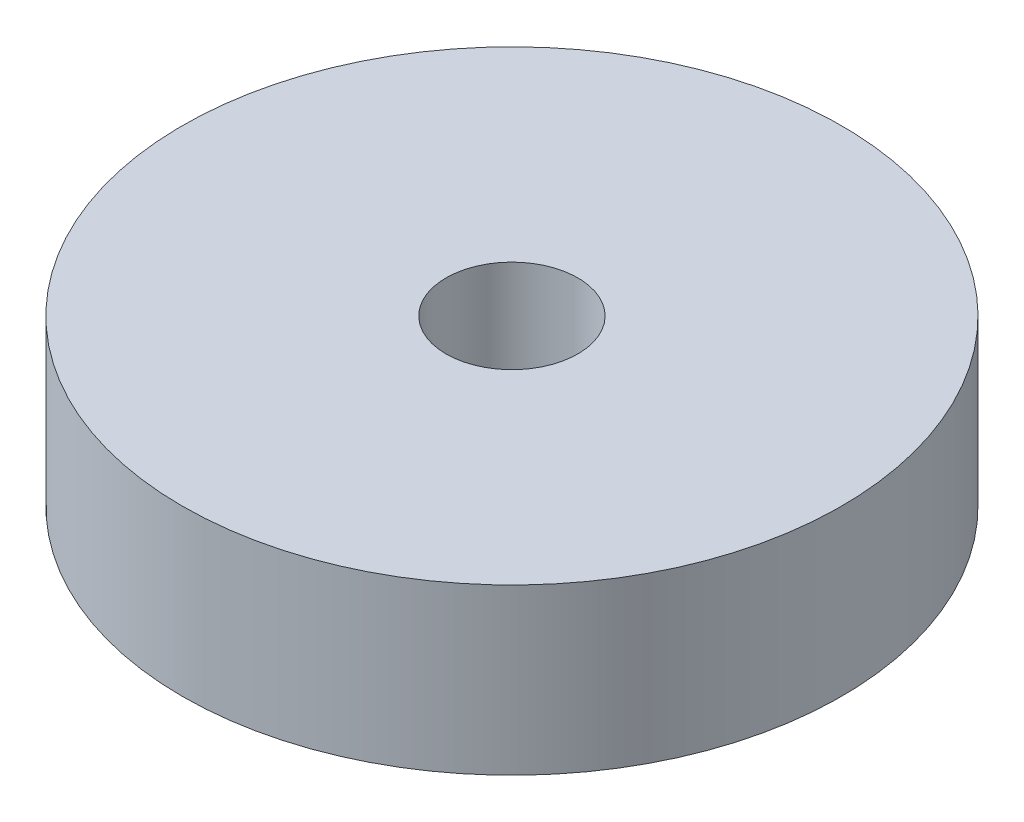
ISO-10303-21;
HEADER;
FILE_DESCRIPTION(('STEP AP214'),'2;1');
FILE_NAME('part.step','',(''),(''),'','','');
FILE_SCHEMA(('AUTOMOTIVE_DESIGN { 1 0 10303 214 1 1 1 1 }'));
ENDSEC;
DATA;
#1=APPLICATION_CONTEXT('core data for automotive mechanical design processes');
#2=APPLICATION_PROTOCOL_DEFINITION('international standard','automotive_design',2000,#1);
#3=PRODUCT_CONTEXT('',#1,'mechanical');
#4=PRODUCT('Part','Part','',(#3));
#5=PRODUCT_RELATED_PRODUCT_CATEGORY('part','',(#4));
#6=PRODUCT_DEFINITION_FORMATION('','',#4);
#7=PRODUCT_DEFINITION_CONTEXT('part definition',#1,'design');
#8=PRODUCT_DEFINITION('design','',#6,#7);
#9=PRODUCT_DEFINITION_SHAPE('','',#8);
#10=(LENGTH_UNIT() NAMED_UNIT(*) SI_UNIT(.MILLI.,.METRE.));
#11=(NAMED_UNIT(*) PLANE_ANGLE_UNIT() SI_UNIT($,.RADIAN.));
#12=(NAMED_UNIT(*) SI_UNIT($,.STERADIAN.) SOLID_ANGLE_UNIT());
#13=UNCERTAINTY_MEASURE_WITH_UNIT(LENGTH_MEASURE(1.E-05),#10,'distance_accuracy_value','');
#14=(GEOMETRIC_REPRESENTATION_CONTEXT(3) GLOBAL_UNCERTAINTY_ASSIGNED_CONTEXT((#13)) GLOBAL_UNIT_ASSIGNED_CONTEXT((#10,
#11,#12)) REPRESENTATION_CONTEXT('',''));
#15=CARTESIAN_POINT('',(0.,0.,0.));
#16=DIRECTION('',(0.,0.,1.));
#17=DIRECTION('',(1.,0.,0.));
#18=AXIS2_PLACEMENT_3D('',#15,#16,#17);
#19=CARTESIAN_POINT('',(0.,0.,0.));
#20=DIRECTION('',(0.,1.,0.));
#21=DIRECTION('',(0.,0.,1.));
#22=AXIS2_PLACEMENT_3D('',#19,#20,#21);
#23=PLANE('',#22);
#24=CARTESIAN_POINT('',(0.,0.,0.));
#25=DIRECTION('',(0.,1.,0.));
#26=DIRECTION('',(0.,0.,1.));
#27=AXIS2_PLACEMENT_3D('',#24,#25,#26);
#28=CIRCLE('',#27,4.);
#29=CARTESIAN_POINT('',(0.,0.,4.));
#30=VERTEX_POINT('',#29);
#31=EDGE_CURVE('E138',#30,#30,#28,.T.);
#32=ORIENTED_EDGE('',*,*,#31,.T.);
#33=EDGE_LOOP('',(#32));
#34=FACE_BOUND('',#33,.T.);
#35=CARTESIAN_POINT('',(0.,0.,0.));
#36=DIRECTION('',(0.,1.,0.));
#37=DIRECTION('',(0.,0.,1.));
#38=AXIS2_PLACEMENT_3D('',#35,#36,#37);
#39=CIRCLE('',#38,20.);
#40=CARTESIAN_POINT('',(0.,0.,20.));
#41=VERTEX_POINT('',#40);
#42=EDGE_CURVE('E50',#41,#41,#39,.T.);
#43=ORIENTED_EDGE('',*,*,#42,.F.);
#44=EDGE_LOOP('',(#43));
#45=FACE_BOUND('',#44,.T.);
#46=CARTESIAN_POINT('',(-15.,0.,0.));
#47=DIRECTION('',(0.,1.,0.));
#48=DIRECTION('',(0.,0.,-1.));
#49=AXIS2_PLACEMENT_3D('',#46,#47,#48);
#50=CIRCLE('',#49,4.475);
#51=CARTESIAN_POINT('',(-12.0000060000048,0.,-3.32049107813781));
#52=VERTEX_POINT('',#51);
#53=CARTESIAN_POINT('',(-17.9999939999952,0.,-3.32049107813781));
#54=VERTEX_POINT('',#53);
#55=EDGE_CURVE('E62',#52,#54,#50,.T.);
#56=ORIENTED_EDGE('',*,*,#55,.T.);
#57=DIRECTION('',(0.,0.,1.));
#58=VECTOR('',#57,1.);
#59=CARTESIAN_POINT('',(-17.9999939999952,0.,-3.32049107813781));
#60=LINE('',#59,#58);
#61=CARTESIAN_POINT('',(-17.9999939999952,0.,3.32049107813781));
#62=VERTEX_POINT('',#61);
#63=EDGE_CURVE('E122',#54,#62,#60,.T.);
#64=ORIENTED_EDGE('',*,*,#63,.T.);
#65=CARTESIAN_POINT('',(-15.,0.,0.));
#66=DIRECTION('',(0.,1.,0.));
#67=DIRECTION('',(0.,0.,1.));
#68=AXIS2_PLACEMENT_3D('',#65,#66,#67);
#69=CIRCLE('',#68,4.475);
#70=CARTESIAN_POINT('',(-12.0000060000048,0.,3.32049107813781));
#71=VERTEX_POINT('',#70);
#72=EDGE_CURVE('E108',#62,#71,#69,.T.);
#73=ORIENTED_EDGE('',*,*,#72,.T.);
#74=DIRECTION('',(0.,0.,-1.));
#75=VECTOR('',#74,1.);
#76=CARTESIAN_POINT('',(-12.0000060000048,0.,-3.32049107813781));
#77=LINE('',#76,#75);
#78=EDGE_CURVE('E128',#71,#52,#77,.T.);
#79=ORIENTED_EDGE('',*,*,#78,.T.);
#80=EDGE_LOOP('',(#56,#64,#73,#79));
#81=FACE_BOUND('',#80,.T.);
#82=ADVANCED_FACE('F45',(#34,#45,#81),#23,.F.);
#83=CARTESIAN_POINT('',(0.,10.,0.));
#84=DIRECTION('',(0.,1.,0.));
#85=DIRECTION('',(0.,0.,1.));
#86=AXIS2_PLACEMENT_3D('',#83,#84,#85);
#87=PLANE('',#86);
#88=CARTESIAN_POINT('',(0.,10.,0.));
#89=DIRECTION('',(0.,1.,0.));
#90=DIRECTION('',(0.,0.,1.));
#91=AXIS2_PLACEMENT_3D('',#88,#89,#90);
#92=CIRCLE('',#91,20.);
#93=CARTESIAN_POINT('',(0.,10.,20.));
#94=VERTEX_POINT('',#93);
#95=EDGE_CURVE('E11',#94,#94,#92,.T.);
#96=ORIENTED_EDGE('',*,*,#95,.T.);
#97=EDGE_LOOP('',(#96));
#98=FACE_BOUND('',#97,.T.);
#99=CARTESIAN_POINT('',(0.,10.,0.));
#100=DIRECTION('',(0.,1.,0.));
#101=DIRECTION('',(0.,0.,1.));
#102=AXIS2_PLACEMENT_3D('',#99,#100,#101);
#103=CIRCLE('',#102,4.);
#104=CARTESIAN_POINT('',(0.,10.,4.));
#105=VERTEX_POINT('',#104);
#106=EDGE_CURVE('E139',#105,#105,#103,.T.);
#107=ORIENTED_EDGE('',*,*,#106,.F.);
#108=EDGE_LOOP('',(#107));
#109=FACE_BOUND('',#108,.T.);
#110=ADVANCED_FACE('F159',(#98,#109),#87,.T.);
#111=CARTESIAN_POINT('',(0.,10.,0.));
#112=DIRECTION('',(0.,-1.,0.));
#113=DIRECTION('',(0.,0.,-1.));
#114=AXIS2_PLACEMENT_3D('',#111,#112,#113);
#115=CYLINDRICAL_SURFACE('',#114,20.);
#116=CARTESIAN_POINT('',(-20.,0.875,0.));
#117=CARTESIAN_POINT('',(-19.9999985543641,0.875005132716817,-0.119002318654872));
#118=CARTESIAN_POINT('',(-19.9989266133591,0.885030057199006,-0.238082328281405));
#119=CARTESIAN_POINT('',(-19.994753511411,0.924868525647715,-0.472938179572813));
#120=CARTESIAN_POINT('',(-19.9916501416462,0.95470361018752,-0.588710281300575));
#121=CARTESIAN_POINT('',(-19.983764335847,1.03328160198327,-0.813515575796172));
#122=CARTESIAN_POINT('',(-19.9789829408586,1.0820127880701,-0.92255289760688));
#123=CARTESIAN_POINT('',(-19.9682750711262,1.19697623623888,-1.13087772410912));
#124=CARTESIAN_POINT('',(-19.9623488169261,1.26320512849416,-1.23016710108115));
#125=CARTESIAN_POINT('',(-19.9499878236992,1.41157065785019,-1.41660151468071));
#126=CARTESIAN_POINT('',(-19.943551333823,1.49376360872208,-1.50370162470748));
#127=CARTESIAN_POINT('',(-19.9309096948547,1.67160373230096,-1.66289871141482));
#128=CARTESIAN_POINT('',(-19.9247045567132,1.76725154084467,-1.73499497865878));
#129=CARTESIAN_POINT('',(-19.9132104934257,1.9695702686182,-1.86229908164563));
#130=CARTESIAN_POINT('',(-19.9079238070203,2.07626713802732,-1.9174658954072));
#131=CARTESIAN_POINT('',(-19.8988873242937,2.29747567849733,-2.00908317129877));
#132=CARTESIAN_POINT('',(-19.8951374853904,2.41198713293369,-2.04553415200322));
#133=CARTESIAN_POINT('',(-19.8896153509464,2.64511387907973,-2.09855099492906));
#134=CARTESIAN_POINT('',(-19.8878356105458,2.76371196261325,-2.11519173672994));
#135=CARTESIAN_POINT('',(-19.8864321622064,3.00202999548482,-2.12834725447185));
#136=CARTESIAN_POINT('',(-19.8868083907386,3.12174991166262,-2.12486262343703));
#137=CARTESIAN_POINT('',(-19.8896675674964,3.35839573815169,-2.09792796902858));
#138=CARTESIAN_POINT('',(-19.8921418712044,3.47533109194703,-2.07455986842805));
#139=CARTESIAN_POINT('',(-19.8989049113606,3.70361081972851,-2.0086491598871));
#140=CARTESIAN_POINT('',(-19.903193675155,3.81495510942233,-1.96610626295893));
#141=CARTESIAN_POINT('',(-19.9131123192281,4.02914986062322,-1.86296371787319));
#142=CARTESIAN_POINT('',(-19.9187448817063,4.13198277347152,-1.80232789507299));
#143=CARTESIAN_POINT('',(-19.9307142591117,4.32604363094284,-1.664746692424));
#144=CARTESIAN_POINT('',(-19.9370510973167,4.4172711917709,-1.58780077341618));
#145=CARTESIAN_POINT('',(-19.9497535315804,4.5860076566779,-1.41932684333144));
#146=CARTESIAN_POINT('',(-19.9561191136751,4.66344596995745,-1.32772811283891));
#147=CARTESIAN_POINT('',(-19.9681320618385,4.80185804545786,-1.13279379942836));
#148=CARTESIAN_POINT('',(-19.973779426936,4.86283178541256,-1.02945820063806));
#149=CARTESIAN_POINT('',(-19.9837218438056,4.96658172149134,-0.813933291553901));
#150=CARTESIAN_POINT('',(-19.9880166150906,5.00935414385782,-0.701742150913042));
#151=CARTESIAN_POINT('',(-19.9947671658392,5.07543457406966,-0.471714763493149));
#152=CARTESIAN_POINT('',(-19.9972230074099,5.09874323927831,-0.353878707505988));
#153=CARTESIAN_POINT('',(-20.0000109938001,5.12514451050795,-0.116517519225221));
#154=CARTESIAN_POINT('',(-20.0003533672895,5.1283344877008,0.00299666744105118));
#155=CARTESIAN_POINT('',(-19.9989033124216,5.11466385420106,0.240857942170475));
#156=CARTESIAN_POINT('',(-19.9971109166935,5.09780354997051,0.3592050480442));
#157=CARTESIAN_POINT('',(-19.9915992262496,5.04459176394286,0.591090241597354));
#158=CARTESIAN_POINT('',(-19.9878844584065,5.00828606587934,0.704638952197754));
#159=CARTESIAN_POINT('',(-19.9789445597039,4.91726125384037,0.924034815223997));
#160=CARTESIAN_POINT('',(-19.9737193908808,4.86254167703266,1.0298817739852));
#161=CARTESIAN_POINT('',(-19.9623172000526,4.73600226999095,1.23130854581286));
#162=CARTESIAN_POINT('',(-19.9561366606641,4.66411869170258,1.32684810900502));
#163=CARTESIAN_POINT('',(-19.94352800511,4.50538291463806,1.5045401666377));
#164=CARTESIAN_POINT('',(-19.9370998819166,4.41853029071652,1.58669228072377));
#165=CARTESIAN_POINT('',(-19.9246895877251,4.23189603835414,1.73561723283508));
#166=CARTESIAN_POINT('',(-19.9187093413435,4.13206315129762,1.80232601620901));
#167=CARTESIAN_POINT('',(-19.9079017650207,3.92255413712458,1.9180298536154));
#168=CARTESIAN_POINT('',(-19.9030744175733,3.81287815950454,1.96702517662241));
#169=CARTESIAN_POINT('',(-19.8951315094289,3.58701294443903,2.04580486641032));
#170=CARTESIAN_POINT('',(-19.8920125955301,3.47083696259292,2.07562688544175));
#171=CARTESIAN_POINT('',(-19.8878294747629,3.23509158229571,2.11533540138205));
#172=CARTESIAN_POINT('',(-19.8867652006591,3.11552229501599,2.12522255063372));
#173=CARTESIAN_POINT('',(-19.8868134070062,2.87702120509197,2.12477094932459));
#174=CARTESIAN_POINT('',(-19.8879150585486,2.7580891969951,2.1145328185222));
#175=CARTESIAN_POINT('',(-19.8921478549579,2.5236452669607,2.0743327343134));
#176=CARTESIAN_POINT('',(-19.8952790016987,2.40813334818094,2.04437076269649));
#177=CARTESIAN_POINT('',(-19.9032149049858,2.18381223649781,1.96560215039115));
#178=CARTESIAN_POINT('',(-19.9080193595801,2.07500183845667,1.9167989094784));
#179=CARTESIAN_POINT('',(-19.9187611259713,1.86710024799775,1.80174330184919));
#180=CARTESIAN_POINT('',(-19.9246984361907,1.76800904204758,1.73549095942823));
#181=CARTESIAN_POINT('',(-19.937072511817,1.58184313897689,1.58704073592645));
#182=CARTESIAN_POINT('',(-19.9435115384828,1.49482842378891,1.50476781954108));
#183=CARTESIAN_POINT('',(-19.9561430028188,1.33579742300951,1.32676312270689));
#184=CARTESIAN_POINT('',(-19.962335381288,1.26378472088894,1.23102813575343));
#185=CARTESIAN_POINT('',(-19.9737942128913,1.13663932263611,1.02851895932899));
#186=CARTESIAN_POINT('',(-19.9790580210637,1.08155452387358,0.92171456886173));
#187=CARTESIAN_POINT('',(-19.9880384700698,0.990175899406319,0.700382279284114));
#188=CARTESIAN_POINT('',(-19.9917568399881,0.953861062135934,0.585863179312426));
#189=CARTESIAN_POINT('',(-19.9963017824917,0.910025864159585,0.392256680019325));
#190=CARTESIAN_POINT('',(-19.9976820813807,0.896909321755802,0.314403368586385));
#191=CARTESIAN_POINT('',(-19.9995316670182,0.879394709679078,0.157711411025117));
#192=CARTESIAN_POINT('',(-20.0000009581436,0.87499659812014,0.0788727696324448));
#193=CARTESIAN_POINT('',(-20.,0.875,0.));
#194=B_SPLINE_CURVE_WITH_KNOTS('',3,(#116,#117,#118,#119,#120,#121,#122,#123,#124,#125,#126,
#127,#128,#129,#130,#131,#132,#133,#134,#135,#136,#137,#138,#139,#140,#141,#142,#143,#144,#145,
#146,#147,#148,#149,#150,#151,#152,#153,#154,#155,#156,#157,#158,#159,#160,#161,#162,#163,#164,
#165,#166,#167,#168,#169,#170,#171,#172,#173,#174,#175,#176,#177,#178,#179,#180,#181,#182,#183,
#184,#185,#186,#187,#188,#189,#190,#191,#192,#193),.UNSPECIFIED.,.T.,.F.,(4,2,2,2,2,2,2,2,2,2,2,
2,2,2,2,2,2,2,2,2,2,2,2,2,2,2,2,2,2,2,2,2,2,2,2,2,2,2,4),(0.,0.356718923506111,0.71382636184089,
1.07071264143202,1.42753023948613,1.78563016608633,2.14374702111669,2.50272490401425,
2.86169283988958,3.21929958127927,3.57689578530648,3.93302573601439,4.2891610542179,
4.64601324879157,5.00287724158483,5.36151864660865,5.72016053664504,6.07887674926273,
6.437580846213,6.7945475329784,7.15150876369382,7.50763320838829,7.86376660492835,
8.22124385839117,8.57873126646687,8.93767587931535,9.29661504144893,9.65484715358904,
10.0130675428569,10.3695015032197,10.7259357926691,11.0823057960741,11.4386753032849,
11.7967559235453,12.1549219792659,12.5140923251283,12.8728597311327,13.1092882727554,
13.3457156785005),.UNSPECIFIED.);
#195=CARTESIAN_POINT('',(-20.,0.875,0.));
#196=VERTEX_POINT('',#195);
#197=EDGE_CURVE('E123',#196,#196,#194,.T.);
#198=ORIENTED_EDGE('',*,*,#197,.T.);
#199=EDGE_LOOP('',(#198));
#200=FACE_BOUND('',#199,.T.);
#201=ORIENTED_EDGE('',*,*,#95,.F.);
#202=EDGE_LOOP('',(#201));
#203=FACE_BOUND('',#202,.T.);
#204=ORIENTED_EDGE('',*,*,#42,.T.);
#205=EDGE_LOOP('',(#204));
#206=FACE_BOUND('',#205,.T.);
#207=ADVANCED_FACE('F47',(#200,#203,#206),#115,.T.);
#208=CARTESIAN_POINT('',(0.,10.,0.));
#209=DIRECTION('',(0.,-1.,0.));
#210=DIRECTION('',(0.,0.,-1.));
#211=AXIS2_PLACEMENT_3D('',#208,#209,#210);
#212=CYLINDRICAL_SURFACE('',#211,4.);
#213=ORIENTED_EDGE('',*,*,#106,.T.);
#214=EDGE_LOOP('',(#213));
#215=FACE_BOUND('',#214,.T.);
#216=ORIENTED_EDGE('',*,*,#31,.F.);
#217=EDGE_LOOP('',(#216));
#218=FACE_BOUND('',#217,.T.);
#219=ADVANCED_FACE('F149',(#215,#218),#212,.F.);
#220=CARTESIAN_POINT('',(-15.,7.,0.));
#221=DIRECTION('',(0.,-1.,0.));
#222=DIRECTION('',(0.,0.,-1.));
#223=AXIS2_PLACEMENT_3D('',#220,#221,#222);
#224=CYLINDRICAL_SURFACE('',#223,4.475);
#225=ORIENTED_EDGE('',*,*,#55,.F.);
#226=DIRECTION('',(0.,-1.,0.));
#227=VECTOR('',#226,1.);
#228=CARTESIAN_POINT('',(-12.0000060000048,7.,-3.32049107813781));
#229=LINE('',#228,#227);
#230=CARTESIAN_POINT('',(-12.0000060000048,7.,-3.32049107813781));
#231=VERTEX_POINT('',#230);
#232=EDGE_CURVE('E116',#231,#52,#229,.T.);
#233=ORIENTED_EDGE('',*,*,#232,.F.);
#234=CARTESIAN_POINT('',(-15.,7.,0.));
#235=DIRECTION('',(0.,1.,0.));
#236=DIRECTION('',(0.,0.,-1.));
#237=AXIS2_PLACEMENT_3D('',#234,#235,#236);
#238=CIRCLE('',#237,4.475);
#239=CARTESIAN_POINT('',(-17.9999939999952,7.,-3.32049107813781));
#240=VERTEX_POINT('',#239);
#241=EDGE_CURVE('E104',#231,#240,#238,.T.);
#242=ORIENTED_EDGE('',*,*,#241,.T.);
#243=DIRECTION('',(0.,-1.,0.));
#244=VECTOR('',#243,1.);
#245=CARTESIAN_POINT('',(-17.9999939999952,7.,-3.32049107813781));
#246=LINE('',#245,#244);
#247=EDGE_CURVE('E101',#240,#54,#246,.T.);
#248=ORIENTED_EDGE('',*,*,#247,.T.);
#249=EDGE_LOOP('',(#225,#233,#242,#248));
#250=FACE_BOUND('',#249,.T.);
#251=ADVANCED_FACE('F151',(#250),#224,.F.);
#252=CARTESIAN_POINT('',(-17.9999939999952,7.,-3.32049107813781));
#253=DIRECTION('',(1.,0.,0.));
#254=DIRECTION('',(0.,0.,-1.));
#255=AXIS2_PLACEMENT_3D('',#252,#253,#254);
#256=PLANE('',#255);
#257=CARTESIAN_POINT('',(-17.9999939999952,3.,0.));
#258=DIRECTION('',(1.,0.,0.));
#259=DIRECTION('',(0.,0.,-1.));
#260=AXIS2_PLACEMENT_3D('',#257,#258,#259);
#261=CIRCLE('',#260,2.125);
#262=CARTESIAN_POINT('',(-17.9999939999952,3.,-2.125));
#263=VERTEX_POINT('',#262);
#264=EDGE_CURVE('E188',#263,#263,#261,.T.);
#265=ORIENTED_EDGE('',*,*,#264,.F.);
#266=EDGE_LOOP('',(#265));
#267=FACE_BOUND('',#266,.T.);
#268=ORIENTED_EDGE('',*,*,#63,.F.);
#269=ORIENTED_EDGE('',*,*,#247,.F.);
#270=DIRECTION('',(0.,0.,1.));
#271=VECTOR('',#270,1.);
#272=CARTESIAN_POINT('',(-17.9999939999952,7.,-3.32049107813781));
#273=LINE('',#272,#271);
#274=CARTESIAN_POINT('',(-17.9999939999952,7.,3.32049107813781));
#275=VERTEX_POINT('',#274);
#276=EDGE_CURVE('E94',#240,#275,#273,.T.);
#277=ORIENTED_EDGE('',*,*,#276,.T.);
#278=DIRECTION('',(0.,-1.,0.));
#279=VECTOR('',#278,1.);
#280=CARTESIAN_POINT('',(-17.9999939999952,7.,3.32049107813781));
#281=LINE('',#280,#279);
#282=EDGE_CURVE('E100',#275,#62,#281,.T.);
#283=ORIENTED_EDGE('',*,*,#282,.T.);
#284=EDGE_LOOP('',(#268,#269,#277,#283));
#285=FACE_BOUND('',#284,.T.);
#286=ADVANCED_FACE('F99',(#267,#285),#256,.T.);
#287=CARTESIAN_POINT('',(-15.,7.,0.));
#288=DIRECTION('',(0.,-1.,0.));
#289=DIRECTION('',(0.,0.,-1.));
#290=AXIS2_PLACEMENT_3D('',#287,#288,#289);
#291=CYLINDRICAL_SURFACE('',#290,4.475);
#292=ORIENTED_EDGE('',*,*,#72,.F.);
#293=ORIENTED_EDGE('',*,*,#282,.F.);
#294=CARTESIAN_POINT('',(-15.,7.,0.));
#295=DIRECTION('',(0.,1.,0.));
#296=DIRECTION('',(0.,0.,1.));
#297=AXIS2_PLACEMENT_3D('',#294,#295,#296);
#298=CIRCLE('',#297,4.475);
#299=CARTESIAN_POINT('',(-12.0000060000048,7.,3.32049107813781));
#300=VERTEX_POINT('',#299);
#301=EDGE_CURVE('E103',#275,#300,#298,.T.);
#302=ORIENTED_EDGE('',*,*,#301,.T.);
#303=DIRECTION('',(0.,-1.,0.));
#304=VECTOR('',#303,1.);
#305=CARTESIAN_POINT('',(-12.0000060000048,7.,3.32049107813781));
#306=LINE('',#305,#304);
#307=EDGE_CURVE('E86',#300,#71,#306,.T.);
#308=ORIENTED_EDGE('',*,*,#307,.T.);
#309=EDGE_LOOP('',(#292,#293,#302,#308));
#310=FACE_BOUND('',#309,.T.);
#311=ADVANCED_FACE('F106',(#310),#291,.F.);
#312=CARTESIAN_POINT('',(-12.0000060000048,7.,-3.32049107813781));
#313=DIRECTION('',(-1.,0.,0.));
#314=DIRECTION('',(0.,0.,1.));
#315=AXIS2_PLACEMENT_3D('',#312,#313,#314);
#316=PLANE('',#315);
#317=ORIENTED_EDGE('',*,*,#78,.F.);
#318=ORIENTED_EDGE('',*,*,#307,.F.);
#319=DIRECTION('',(0.,0.,-1.));
#320=VECTOR('',#319,1.);
#321=CARTESIAN_POINT('',(-12.0000060000048,7.,-3.32049107813781));
#322=LINE('',#321,#320);
#323=EDGE_CURVE('E70',#300,#231,#322,.T.);
#324=ORIENTED_EDGE('',*,*,#323,.T.);
#325=ORIENTED_EDGE('',*,*,#232,.T.);
#326=EDGE_LOOP('',(#317,#318,#324,#325));
#327=FACE_BOUND('',#326,.T.);
#328=ADVANCED_FACE('F178',(#327),#316,.T.);
#329=CARTESIAN_POINT('',(-15.,7.,0.));
#330=DIRECTION('',(0.,-1.,0.));
#331=DIRECTION('',(0.,0.,-1.));
#332=AXIS2_PLACEMENT_3D('',#329,#330,#331);
#333=PLANE('',#332);
#334=ORIENTED_EDGE('',*,*,#241,.F.);
#335=ORIENTED_EDGE('',*,*,#323,.F.);
#336=ORIENTED_EDGE('',*,*,#301,.F.);
#337=ORIENTED_EDGE('',*,*,#276,.F.);
#338=EDGE_LOOP('',(#334,#335,#336,#337));
#339=FACE_BOUND('',#338,.T.);
#340=ADVANCED_FACE('F112',(#339),#333,.T.);
#341=CARTESIAN_POINT('',(-20.,3.,0.));
#342=DIRECTION('',(1.,0.,0.));
#343=DIRECTION('',(0.,0.,-1.));
#344=AXIS2_PLACEMENT_3D('',#341,#342,#343);
#345=CYLINDRICAL_SURFACE('',#344,2.125);
#346=ORIENTED_EDGE('',*,*,#264,.T.);
#347=EDGE_LOOP('',(#346));
#348=FACE_BOUND('',#347,.T.);
#349=ORIENTED_EDGE('',*,*,#197,.F.);
#350=EDGE_LOOP('',(#349));
#351=FACE_BOUND('',#350,.T.);
#352=ADVANCED_FACE('F189',(#348,#351),#345,.F.);
#353=CLOSED_SHELL('',(#82,#110,#207,#219,#251,#286,#311,#328,#340,#352));
#354=MANIFOLD_SOLID_BREP('B2',#353);
#355=ADVANCED_BREP_SHAPE_REPRESENTATION('',(#18,#354),#14);
#356=SHAPE_DEFINITION_REPRESENTATION(#9,#355);
ENDSEC;
END-ISO-10303-21;
